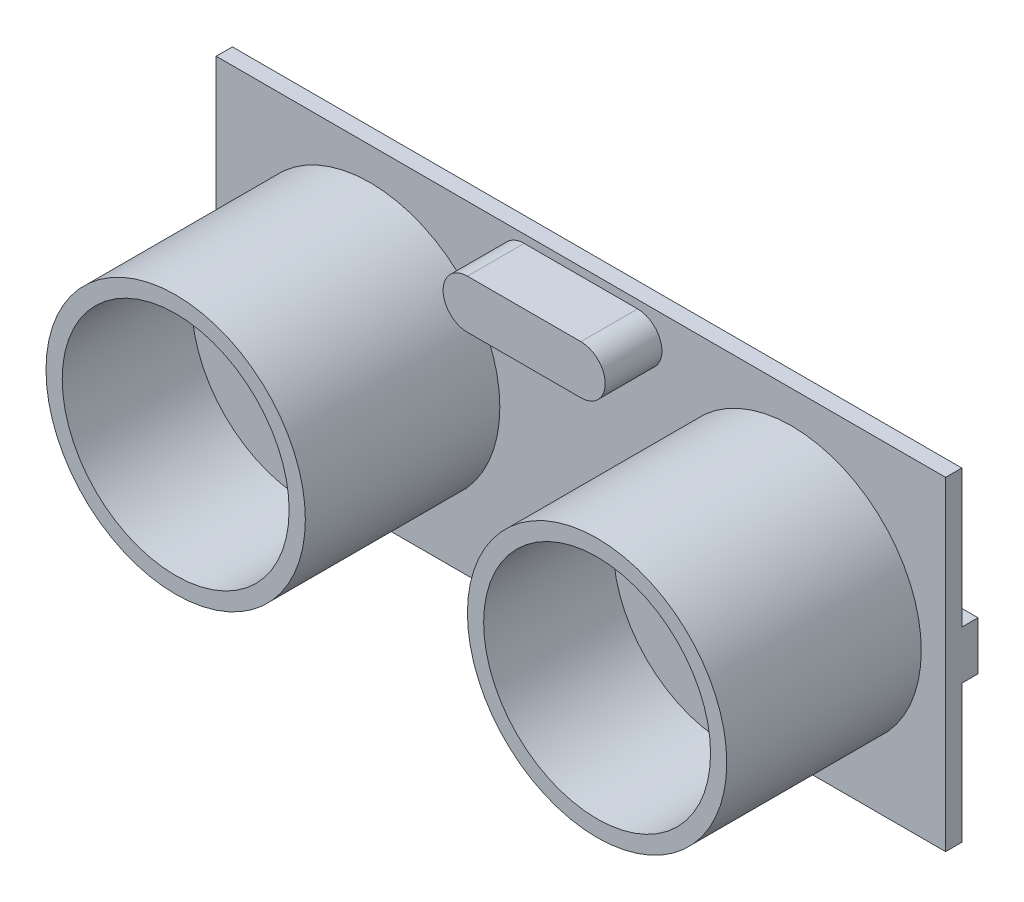
ISO-10303-21;
HEADER;
FILE_DESCRIPTION(('STEP AP214'),'2;1');
FILE_NAME('part.step','',(''),(''),'','','');
FILE_SCHEMA(('AUTOMOTIVE_DESIGN { 1 0 10303 214 1 1 1 1 }'));
ENDSEC;
DATA;
#1=APPLICATION_CONTEXT('core data for automotive mechanical design processes');
#2=APPLICATION_PROTOCOL_DEFINITION('international standard','automotive_design',2000,#1);
#3=PRODUCT_CONTEXT('',#1,'mechanical');
#4=PRODUCT('Part','Part','',(#3));
#5=PRODUCT_RELATED_PRODUCT_CATEGORY('part','',(#4));
#6=PRODUCT_DEFINITION_FORMATION('','',#4);
#7=PRODUCT_DEFINITION_CONTEXT('part definition',#1,'design');
#8=PRODUCT_DEFINITION('design','',#6,#7);
#9=PRODUCT_DEFINITION_SHAPE('','',#8);
#10=(LENGTH_UNIT() NAMED_UNIT(*) SI_UNIT(.MILLI.,.METRE.));
#11=(NAMED_UNIT(*) PLANE_ANGLE_UNIT() SI_UNIT($,.RADIAN.));
#12=(NAMED_UNIT(*) SI_UNIT($,.STERADIAN.) SOLID_ANGLE_UNIT());
#13=UNCERTAINTY_MEASURE_WITH_UNIT(LENGTH_MEASURE(1.E-05),#10,'distance_accuracy_value','');
#14=(GEOMETRIC_REPRESENTATION_CONTEXT(3) GLOBAL_UNCERTAINTY_ASSIGNED_CONTEXT((#13)) GLOBAL_UNIT_ASSIGNED_CONTEXT((#10,
#11,#12)) REPRESENTATION_CONTEXT('',''));
#15=CARTESIAN_POINT('',(0.,0.,0.));
#16=DIRECTION('',(0.,0.,1.));
#17=DIRECTION('',(1.,0.,0.));
#18=AXIS2_PLACEMENT_3D('',#15,#16,#17);
#19=CARTESIAN_POINT('',(0.,0.,0.));
#20=DIRECTION('',(0.,0.,-1.));
#21=DIRECTION('',(-1.,0.,0.));
#22=AXIS2_PLACEMENT_3D('',#19,#20,#21);
#23=PLANE('',#22);
#24=DIRECTION('',(1.,0.,0.));
#25=VECTOR('',#24,1.);
#26=CARTESIAN_POINT('',(3.,1.5,0.));
#27=LINE('',#26,#25);
#28=CARTESIAN_POINT('',(-3.,1.5,0.));
#29=VERTEX_POINT('',#28);
#30=CARTESIAN_POINT('',(3.,1.5,0.));
#31=VERTEX_POINT('',#30);
#32=EDGE_CURVE('E292',#29,#31,#27,.T.);
#33=ORIENTED_EDGE('',*,*,#32,.F.);
#34=DIRECTION('',(0.,1.,0.));
#35=VECTOR('',#34,1.);
#36=CARTESIAN_POINT('',(-3.,1.5,0.));
#37=LINE('',#36,#35);
#38=CARTESIAN_POINT('',(-3.,-1.5,0.));
#39=VERTEX_POINT('',#38);
#40=EDGE_CURVE('E278',#39,#29,#37,.T.);
#41=ORIENTED_EDGE('',*,*,#40,.F.);
#42=DIRECTION('',(-1.,0.,0.));
#43=VECTOR('',#42,1.);
#44=CARTESIAN_POINT('',(3.,-1.5,0.));
#45=LINE('',#44,#43);
#46=CARTESIAN_POINT('',(3.,-1.5,0.));
#47=VERTEX_POINT('',#46);
#48=EDGE_CURVE('E283',#47,#39,#45,.T.);
#49=ORIENTED_EDGE('',*,*,#48,.F.);
#50=DIRECTION('',(0.,-1.,0.));
#51=VECTOR('',#50,1.);
#52=CARTESIAN_POINT('',(3.,1.5,0.));
#53=LINE('',#52,#51);
#54=EDGE_CURVE('E294',#31,#47,#53,.T.);
#55=ORIENTED_EDGE('',*,*,#54,.F.);
#56=EDGE_LOOP('',(#33,#41,#49,#55));
#57=FACE_BOUND('',#56,.T.);
#58=DIRECTION('',(1.,0.,0.));
#59=VECTOR('',#58,1.);
#60=CARTESIAN_POINT('',(-16.9493977736266,3.25,0.));
#61=LINE('',#60,#59);
#62=CARTESIAN_POINT('',(-19.9493977736266,3.25,0.));
#63=VERTEX_POINT('',#62);
#64=CARTESIAN_POINT('',(-16.9493977736266,3.25,0.));
#65=VERTEX_POINT('',#64);
#66=EDGE_CURVE('E224',#63,#65,#61,.T.);
#67=ORIENTED_EDGE('',*,*,#66,.F.);
#68=DIRECTION('',(0.,1.,0.));
#69=VECTOR('',#68,1.);
#70=CARTESIAN_POINT('',(-19.9493977736266,-3.25,0.));
#71=LINE('',#70,#69);
#72=CARTESIAN_POINT('',(-19.9493977736266,-3.25,0.));
#73=VERTEX_POINT('',#72);
#74=EDGE_CURVE('E221',#73,#63,#71,.T.);
#75=ORIENTED_EDGE('',*,*,#74,.F.);
#76=DIRECTION('',(-1.,0.,0.));
#77=VECTOR('',#76,1.);
#78=CARTESIAN_POINT('',(-16.9493977736266,-3.25,0.));
#79=LINE('',#78,#77);
#80=CARTESIAN_POINT('',(-16.9493977736266,-3.25,0.));
#81=VERTEX_POINT('',#80);
#82=EDGE_CURVE('E233',#81,#73,#79,.T.);
#83=ORIENTED_EDGE('',*,*,#82,.F.);
#84=DIRECTION('',(0.,-1.,0.));
#85=VECTOR('',#84,1.);
#86=CARTESIAN_POINT('',(-16.9493977736266,-3.25,0.));
#87=LINE('',#86,#85);
#88=EDGE_CURVE('E241',#65,#81,#87,.T.);
#89=ORIENTED_EDGE('',*,*,#88,.F.);
#90=EDGE_LOOP('',(#67,#75,#83,#89));
#91=FACE_BOUND('',#90,.T.);
#92=DIRECTION('',(1.,0.,0.));
#93=VECTOR('',#92,1.);
#94=CARTESIAN_POINT('',(6.34999999999999,-5.,0.));
#95=LINE('',#94,#93);
#96=CARTESIAN_POINT('',(-6.35000000000001,-5.,0.));
#97=VERTEX_POINT('',#96);
#98=CARTESIAN_POINT('',(6.34999999999999,-5.,0.));
#99=VERTEX_POINT('',#98);
#100=EDGE_CURVE('E424',#97,#99,#95,.T.);
#101=ORIENTED_EDGE('',*,*,#100,.F.);
#102=DIRECTION('',(0.,1.,0.));
#103=VECTOR('',#102,1.);
#104=CARTESIAN_POINT('',(-6.35000000000001,-5.,0.));
#105=LINE('',#104,#103);
#106=CARTESIAN_POINT('',(-6.35000000000001,-10.,0.));
#107=VERTEX_POINT('',#106);
#108=EDGE_CURVE('E219',#107,#97,#105,.T.);
#109=ORIENTED_EDGE('',*,*,#108,.F.);
#110=DIRECTION('',(1.,0.,0.));
#111=VECTOR('',#110,1.);
#112=CARTESIAN_POINT('',(-22.5,-10.,0.));
#113=LINE('',#112,#111);
#114=CARTESIAN_POINT('',(-22.5,-10.,0.));
#115=VERTEX_POINT('',#114);
#116=EDGE_CURVE('E362',#115,#107,#113,.T.);
#117=ORIENTED_EDGE('',*,*,#116,.F.);
#118=DIRECTION('',(0.,-1.,0.));
#119=VECTOR('',#118,1.);
#120=CARTESIAN_POINT('',(-22.5,-10.,0.));
#121=LINE('',#120,#119);
#122=CARTESIAN_POINT('',(-22.5,10.,0.));
#123=VERTEX_POINT('',#122);
#124=EDGE_CURVE('E374',#123,#115,#121,.T.);
#125=ORIENTED_EDGE('',*,*,#124,.F.);
#126=DIRECTION('',(-1.,0.,0.));
#127=VECTOR('',#126,1.);
#128=CARTESIAN_POINT('',(-22.5,10.,0.));
#129=LINE('',#128,#127);
#130=CARTESIAN_POINT('',(22.5,10.,0.));
#131=VERTEX_POINT('',#130);
#132=EDGE_CURVE('E372',#131,#123,#129,.T.);
#133=ORIENTED_EDGE('',*,*,#132,.F.);
#134=DIRECTION('',(0.,1.,0.));
#135=VECTOR('',#134,1.);
#136=CARTESIAN_POINT('',(22.5,-10.,0.));
#137=LINE('',#136,#135);
#138=CARTESIAN_POINT('',(22.5,1.5,0.));
#139=VERTEX_POINT('',#138);
#140=EDGE_CURVE('E357',#139,#131,#137,.T.);
#141=ORIENTED_EDGE('',*,*,#140,.F.);
#142=DIRECTION('',(1.,0.,0.));
#143=VECTOR('',#142,1.);
#144=CARTESIAN_POINT('',(22.5,1.5,0.));
#145=LINE('',#144,#143);
#146=CARTESIAN_POINT('',(16.5,1.5,0.));
#147=VERTEX_POINT('',#146);
#148=EDGE_CURVE('E266',#147,#139,#145,.T.);
#149=ORIENTED_EDGE('',*,*,#148,.F.);
#150=DIRECTION('',(0.,1.,0.));
#151=VECTOR('',#150,1.);
#152=CARTESIAN_POINT('',(16.5,1.5,0.));
#153=LINE('',#152,#151);
#154=CARTESIAN_POINT('',(16.5,-1.5,0.));
#155=VERTEX_POINT('',#154);
#156=EDGE_CURVE('E252',#155,#147,#153,.T.);
#157=ORIENTED_EDGE('',*,*,#156,.F.);
#158=DIRECTION('',(-1.,0.,0.));
#159=VECTOR('',#158,1.);
#160=CARTESIAN_POINT('',(22.5,-1.5,0.));
#161=LINE('',#160,#159);
#162=CARTESIAN_POINT('',(22.5,-1.5,0.));
#163=VERTEX_POINT('',#162);
#164=EDGE_CURVE('E257',#163,#155,#161,.T.);
#165=ORIENTED_EDGE('',*,*,#164,.F.);
#166=CARTESIAN_POINT('',(22.5,-10.,0.));
#167=VERTEX_POINT('',#166);
#168=EDGE_CURVE('E369',#167,#163,#137,.T.);
#169=ORIENTED_EDGE('',*,*,#168,.F.);
#170=CARTESIAN_POINT('',(6.34999999999998,-10.,0.));
#171=VERTEX_POINT('',#170);
#172=EDGE_CURVE('E376',#171,#167,#113,.T.);
#173=ORIENTED_EDGE('',*,*,#172,.F.);
#174=DIRECTION('',(0.,-1.,0.));
#175=VECTOR('',#174,1.);
#176=CARTESIAN_POINT('',(6.34999999999999,-5.,0.));
#177=LINE('',#176,#175);
#178=EDGE_CURVE('E215',#99,#171,#177,.T.);
#179=ORIENTED_EDGE('',*,*,#178,.F.);
#180=EDGE_LOOP('',(#101,#109,#117,#125,#133,#141,#149,#157,#165,#169,#173,#179));
#181=FACE_BOUND('',#180,.T.);
#182=ADVANCED_FACE('F35',(#57,#91,#181),#23,.T.);
#183=CARTESIAN_POINT('',(22.5,-10.,1.));
#184=DIRECTION('',(-1.,0.,0.));
#185=DIRECTION('',(0.,0.,1.));
#186=AXIS2_PLACEMENT_3D('',#183,#184,#185);
#187=PLANE('',#186);
#188=ORIENTED_EDGE('',*,*,#168,.T.);
#189=DIRECTION('',(0.,0.,1.));
#190=VECTOR('',#189,1.);
#191=CARTESIAN_POINT('',(22.5,-1.5,-1.));
#192=LINE('',#191,#190);
#193=CARTESIAN_POINT('',(22.5,-1.5,-1.));
#194=VERTEX_POINT('',#193);
#195=EDGE_CURVE('E272',#194,#163,#192,.T.);
#196=ORIENTED_EDGE('',*,*,#195,.F.);
#197=DIRECTION('',(0.,-1.,0.));
#198=VECTOR('',#197,1.);
#199=CARTESIAN_POINT('',(22.5,1.5,-1.));
#200=LINE('',#199,#198);
#201=CARTESIAN_POINT('',(22.5,1.5,-1.));
#202=VERTEX_POINT('',#201);
#203=EDGE_CURVE('E259',#202,#194,#200,.T.);
#204=ORIENTED_EDGE('',*,*,#203,.F.);
#205=DIRECTION('',(0.,0.,1.));
#206=VECTOR('',#205,1.);
#207=CARTESIAN_POINT('',(22.5,1.5,-1.));
#208=LINE('',#207,#206);
#209=EDGE_CURVE('E274',#202,#139,#208,.T.);
#210=ORIENTED_EDGE('',*,*,#209,.T.);
#211=ORIENTED_EDGE('',*,*,#140,.T.);
#212=DIRECTION('',(0.,0.,-1.));
#213=VECTOR('',#212,1.);
#214=CARTESIAN_POINT('',(22.5,10.,1.));
#215=LINE('',#214,#213);
#216=CARTESIAN_POINT('',(22.5,10.,1.));
#217=VERTEX_POINT('',#216);
#218=EDGE_CURVE('E387',#217,#131,#215,.T.);
#219=ORIENTED_EDGE('',*,*,#218,.F.);
#220=DIRECTION('',(0.,1.,0.));
#221=VECTOR('',#220,1.);
#222=CARTESIAN_POINT('',(22.5,-10.,1.));
#223=LINE('',#222,#221);
#224=CARTESIAN_POINT('',(22.5,-10.,1.));
#225=VERTEX_POINT('',#224);
#226=EDGE_CURVE('E358',#225,#217,#223,.T.);
#227=ORIENTED_EDGE('',*,*,#226,.F.);
#228=DIRECTION('',(0.,0.,-1.));
#229=VECTOR('',#228,1.);
#230=CARTESIAN_POINT('',(22.5,-10.,1.));
#231=LINE('',#230,#229);
#232=EDGE_CURVE('E368',#225,#167,#231,.T.);
#233=ORIENTED_EDGE('',*,*,#232,.T.);
#234=EDGE_LOOP('',(#188,#196,#204,#210,#211,#219,#227,#233));
#235=FACE_BOUND('',#234,.T.);
#236=ADVANCED_FACE('F37',(#235),#187,.F.);
#237=CARTESIAN_POINT('',(-22.5,10.,1.));
#238=DIRECTION('',(0.,-1.,0.));
#239=DIRECTION('',(0.,0.,-1.));
#240=AXIS2_PLACEMENT_3D('',#237,#238,#239);
#241=PLANE('',#240);
#242=ORIENTED_EDGE('',*,*,#132,.T.);
#243=DIRECTION('',(0.,0.,-1.));
#244=VECTOR('',#243,1.);
#245=CARTESIAN_POINT('',(-22.5,10.,1.));
#246=LINE('',#245,#244);
#247=CARTESIAN_POINT('',(-22.5,10.,1.));
#248=VERTEX_POINT('',#247);
#249=EDGE_CURVE('E384',#248,#123,#246,.T.);
#250=ORIENTED_EDGE('',*,*,#249,.F.);
#251=DIRECTION('',(-1.,0.,0.));
#252=VECTOR('',#251,1.);
#253=CARTESIAN_POINT('',(-22.5,10.,1.));
#254=LINE('',#253,#252);
#255=EDGE_CURVE('E361',#217,#248,#254,.T.);
#256=ORIENTED_EDGE('',*,*,#255,.F.);
#257=ORIENTED_EDGE('',*,*,#218,.T.);
#258=EDGE_LOOP('',(#242,#250,#256,#257));
#259=FACE_BOUND('',#258,.T.);
#260=ADVANCED_FACE('F466',(#259),#241,.F.);
#261=CARTESIAN_POINT('',(-22.5,-10.,1.));
#262=DIRECTION('',(1.,0.,0.));
#263=DIRECTION('',(0.,0.,-1.));
#264=AXIS2_PLACEMENT_3D('',#261,#262,#263);
#265=PLANE('',#264);
#266=ORIENTED_EDGE('',*,*,#124,.T.);
#267=DIRECTION('',(0.,0.,-1.));
#268=VECTOR('',#267,1.);
#269=CARTESIAN_POINT('',(-22.5,-10.,1.));
#270=LINE('',#269,#268);
#271=CARTESIAN_POINT('',(-22.5,-10.,1.));
#272=VERTEX_POINT('',#271);
#273=EDGE_CURVE('E381',#272,#115,#270,.T.);
#274=ORIENTED_EDGE('',*,*,#273,.F.);
#275=DIRECTION('',(0.,-1.,0.));
#276=VECTOR('',#275,1.);
#277=CARTESIAN_POINT('',(-22.5,-10.,1.));
#278=LINE('',#277,#276);
#279=EDGE_CURVE('E364',#248,#272,#278,.T.);
#280=ORIENTED_EDGE('',*,*,#279,.F.);
#281=ORIENTED_EDGE('',*,*,#249,.T.);
#282=EDGE_LOOP('',(#266,#274,#280,#281));
#283=FACE_BOUND('',#282,.T.);
#284=ADVANCED_FACE('F410',(#283),#265,.F.);
#285=CARTESIAN_POINT('',(-22.5,-10.,1.));
#286=DIRECTION('',(0.,1.,0.));
#287=DIRECTION('',(0.,0.,1.));
#288=AXIS2_PLACEMENT_3D('',#285,#286,#287);
#289=PLANE('',#288);
#290=CARTESIAN_POINT('',(3.76999999999999,-10.,-2.09800404078398));
#291=DIRECTION('',(0.,1.,0.));
#292=DIRECTION('',(0.,0.,1.));
#293=AXIS2_PLACEMENT_3D('',#290,#291,#292);
#294=CIRCLE('',#293,0.5);
#295=CARTESIAN_POINT('',(3.76999999999999,-10.,-1.59800404078398));
#296=VERTEX_POINT('',#295);
#297=EDGE_CURVE('E11',#296,#296,#294,.F.);
#298=ORIENTED_EDGE('',*,*,#297,.F.);
#299=EDGE_LOOP('',(#298));
#300=FACE_BOUND('',#299,.T.);
#301=CARTESIAN_POINT('',(1.23,-10.,-2.09800404078398));
#302=DIRECTION('',(0.,1.,0.));
#303=DIRECTION('',(0.,0.,1.));
#304=AXIS2_PLACEMENT_3D('',#301,#302,#303);
#305=CIRCLE('',#304,0.5);
#306=CARTESIAN_POINT('',(1.23,-10.,-1.59800404078398));
#307=VERTEX_POINT('',#306);
#308=EDGE_CURVE('E43',#307,#307,#305,.F.);
#309=ORIENTED_EDGE('',*,*,#308,.F.);
#310=EDGE_LOOP('',(#309));
#311=FACE_BOUND('',#310,.T.);
#312=CARTESIAN_POINT('',(-1.31000000000001,-10.,-2.09800404078398));
#313=DIRECTION('',(0.,1.,0.));
#314=DIRECTION('',(0.,0.,1.));
#315=AXIS2_PLACEMENT_3D('',#312,#313,#314);
#316=CIRCLE('',#315,0.5);
#317=CARTESIAN_POINT('',(-1.31000000000001,-10.,-1.59800404078398));
#318=VERTEX_POINT('',#317);
#319=EDGE_CURVE('E399',#318,#318,#316,.F.);
#320=ORIENTED_EDGE('',*,*,#319,.F.);
#321=EDGE_LOOP('',(#320));
#322=FACE_BOUND('',#321,.T.);
#323=CARTESIAN_POINT('',(-3.85000000000001,-10.,-2.09800404078398));
#324=DIRECTION('',(0.,1.,0.));
#325=DIRECTION('',(0.,0.,1.));
#326=AXIS2_PLACEMENT_3D('',#323,#324,#325);
#327=CIRCLE('',#326,0.5);
#328=CARTESIAN_POINT('',(-3.85000000000001,-10.,-1.59800404078398));
#329=VERTEX_POINT('',#328);
#330=EDGE_CURVE('E396',#329,#329,#327,.F.);
#331=ORIENTED_EDGE('',*,*,#330,.F.);
#332=EDGE_LOOP('',(#331));
#333=FACE_BOUND('',#332,.T.);
#334=ORIENTED_EDGE('',*,*,#116,.T.);
#335=DIRECTION('',(0.,0.,1.));
#336=VECTOR('',#335,1.);
#337=CARTESIAN_POINT('',(-6.35000000000001,-10.,-4.));
#338=LINE('',#337,#336);
#339=CARTESIAN_POINT('',(-6.35000000000001,-10.,-4.));
#340=VERTEX_POINT('',#339);
#341=EDGE_CURVE('E417',#340,#107,#338,.T.);
#342=ORIENTED_EDGE('',*,*,#341,.F.);
#343=DIRECTION('',(-1.,0.,0.));
#344=VECTOR('',#343,1.);
#345=CARTESIAN_POINT('',(6.34999999999999,-10.,-4.));
#346=LINE('',#345,#344);
#347=CARTESIAN_POINT('',(6.34999999999999,-10.,-4.));
#348=VERTEX_POINT('',#347);
#349=EDGE_CURVE('E212',#348,#340,#346,.T.);
#350=ORIENTED_EDGE('',*,*,#349,.F.);
#351=DIRECTION('',(0.,0.,1.));
#352=VECTOR('',#351,1.);
#353=CARTESIAN_POINT('',(6.34999999999999,-10.,-4.));
#354=LINE('',#353,#352);
#355=EDGE_CURVE('E50',#348,#171,#354,.T.);
#356=ORIENTED_EDGE('',*,*,#355,.T.);
#357=ORIENTED_EDGE('',*,*,#172,.T.);
#358=ORIENTED_EDGE('',*,*,#232,.F.);
#359=DIRECTION('',(1.,0.,0.));
#360=VECTOR('',#359,1.);
#361=CARTESIAN_POINT('',(-22.5,-10.,1.));
#362=LINE('',#361,#360);
#363=EDGE_CURVE('E366',#272,#225,#362,.T.);
#364=ORIENTED_EDGE('',*,*,#363,.F.);
#365=ORIENTED_EDGE('',*,*,#273,.T.);
#366=EDGE_LOOP('',(#334,#342,#350,#356,#357,#358,#364,#365));
#367=FACE_BOUND('',#366,.T.);
#368=ADVANCED_FACE('F406',(#300,#311,#322,#333,#367),#289,.F.);
#369=CARTESIAN_POINT('',(0.,0.,1.));
#370=DIRECTION('',(0.,0.,-1.));
#371=DIRECTION('',(-1.,0.,0.));
#372=AXIS2_PLACEMENT_3D('',#369,#370,#371);
#373=PLANE('',#372);
#374=DIRECTION('',(1.,0.,0.));
#375=VECTOR('',#374,1.);
#376=CARTESIAN_POINT('',(-3.5,6.5,1.));
#377=LINE('',#376,#375);
#378=CARTESIAN_POINT('',(-3.5,6.5,1.));
#379=VERTEX_POINT('',#378);
#380=CARTESIAN_POINT('',(3.5,6.5,1.));
#381=VERTEX_POINT('',#380);
#382=EDGE_CURVE('E324',#379,#381,#377,.T.);
#383=ORIENTED_EDGE('',*,*,#382,.F.);
#384=CARTESIAN_POINT('',(-3.5,8.,1.));
#385=DIRECTION('',(0.,0.,-1.));
#386=DIRECTION('',(-1.,0.,0.));
#387=AXIS2_PLACEMENT_3D('',#384,#385,#386);
#388=CIRCLE('',#387,1.5);
#389=CARTESIAN_POINT('',(-3.5,9.5,1.));
#390=VERTEX_POINT('',#389);
#391=EDGE_CURVE('E311',#379,#390,#388,.T.);
#392=ORIENTED_EDGE('',*,*,#391,.T.);
#393=DIRECTION('',(1.,0.,0.));
#394=VECTOR('',#393,1.);
#395=CARTESIAN_POINT('',(-3.5,9.5,1.));
#396=LINE('',#395,#394);
#397=CARTESIAN_POINT('',(3.5,9.5,1.));
#398=VERTEX_POINT('',#397);
#399=EDGE_CURVE('E335',#390,#398,#396,.T.);
#400=ORIENTED_EDGE('',*,*,#399,.T.);
#401=CARTESIAN_POINT('',(3.5,8.,1.));
#402=DIRECTION('',(0.,0.,-1.));
#403=DIRECTION('',(-1.,0.,0.));
#404=AXIS2_PLACEMENT_3D('',#401,#402,#403);
#405=CIRCLE('',#404,1.5);
#406=EDGE_CURVE('E338',#398,#381,#405,.T.);
#407=ORIENTED_EDGE('',*,*,#406,.T.);
#408=EDGE_LOOP('',(#383,#392,#400,#407));
#409=FACE_BOUND('',#408,.T.);
#410=CARTESIAN_POINT('',(-13.,0.,1.));
#411=DIRECTION('',(0.,0.,-1.));
#412=DIRECTION('',(-1.,0.,0.));
#413=AXIS2_PLACEMENT_3D('',#410,#411,#412);
#414=CIRCLE('',#413,8.);
#415=CARTESIAN_POINT('',(-21.,0.,1.));
#416=VERTEX_POINT('',#415);
#417=EDGE_CURVE('E393',#416,#416,#414,.F.);
#418=ORIENTED_EDGE('',*,*,#417,.F.);
#419=EDGE_LOOP('',(#418));
#420=FACE_BOUND('',#419,.T.);
#421=CARTESIAN_POINT('',(13.,0.,1.));
#422=DIRECTION('',(0.,0.,-1.));
#423=DIRECTION('',(-1.,0.,0.));
#424=AXIS2_PLACEMENT_3D('',#421,#422,#423);
#425=CIRCLE('',#424,8.);
#426=CARTESIAN_POINT('',(5.,0.,1.));
#427=VERTEX_POINT('',#426);
#428=EDGE_CURVE('E390',#427,#427,#425,.F.);
#429=ORIENTED_EDGE('',*,*,#428,.F.);
#430=EDGE_LOOP('',(#429));
#431=FACE_BOUND('',#430,.T.);
#432=ORIENTED_EDGE('',*,*,#226,.T.);
#433=ORIENTED_EDGE('',*,*,#255,.T.);
#434=ORIENTED_EDGE('',*,*,#279,.T.);
#435=ORIENTED_EDGE('',*,*,#363,.T.);
#436=EDGE_LOOP('',(#432,#433,#434,#435));
#437=FACE_BOUND('',#436,.T.);
#438=ADVANCED_FACE('F409',(#409,#420,#431,#437),#373,.F.);
#439=CARTESIAN_POINT('',(13.,0.,13.));
#440=DIRECTION('',(0.,0.,-1.));
#441=DIRECTION('',(-1.,0.,0.));
#442=AXIS2_PLACEMENT_3D('',#439,#440,#441);
#443=CYLINDRICAL_SURFACE('',#442,8.);
#444=CARTESIAN_POINT('',(13.,0.,13.));
#445=DIRECTION('',(0.,0.,1.));
#446=DIRECTION('',(1.,0.,0.));
#447=AXIS2_PLACEMENT_3D('',#444,#445,#446);
#448=CIRCLE('',#447,8.);
#449=CARTESIAN_POINT('',(21.,0.,13.));
#450=VERTEX_POINT('',#449);
#451=EDGE_CURVE('E354',#450,#450,#448,.T.);
#452=ORIENTED_EDGE('',*,*,#451,.F.);
#453=EDGE_LOOP('',(#452));
#454=FACE_BOUND('',#453,.T.);
#455=ORIENTED_EDGE('',*,*,#428,.T.);
#456=EDGE_LOOP('',(#455));
#457=FACE_BOUND('',#456,.T.);
#458=ADVANCED_FACE('F614',(#454,#457),#443,.T.);
#459=CARTESIAN_POINT('',(13.,0.,13.));
#460=DIRECTION('',(0.,0.,1.));
#461=DIRECTION('',(1.,0.,0.));
#462=AXIS2_PLACEMENT_3D('',#459,#460,#461);
#463=PLANE('',#462);
#464=CARTESIAN_POINT('',(13.,0.,13.));
#465=DIRECTION('',(0.,0.,1.));
#466=DIRECTION('',(1.,0.,0.));
#467=AXIS2_PLACEMENT_3D('',#464,#465,#466);
#468=CIRCLE('',#467,7.);
#469=CARTESIAN_POINT('',(20.,0.,13.));
#470=VERTEX_POINT('',#469);
#471=EDGE_CURVE('E312',#470,#470,#468,.T.);
#472=ORIENTED_EDGE('',*,*,#471,.F.);
#473=EDGE_LOOP('',(#472));
#474=FACE_BOUND('',#473,.T.);
#475=ORIENTED_EDGE('',*,*,#451,.T.);
#476=EDGE_LOOP('',(#475));
#477=FACE_BOUND('',#476,.T.);
#478=ADVANCED_FACE('F611',(#474,#477),#463,.T.);
#479=CARTESIAN_POINT('',(-13.,0.,13.));
#480=DIRECTION('',(0.,0.,-1.));
#481=DIRECTION('',(-1.,0.,0.));
#482=AXIS2_PLACEMENT_3D('',#479,#480,#481);
#483=CYLINDRICAL_SURFACE('',#482,8.);
#484=CARTESIAN_POINT('',(-13.,0.,13.));
#485=DIRECTION('',(0.,0.,1.));
#486=DIRECTION('',(-1.,0.,0.));
#487=AXIS2_PLACEMENT_3D('',#484,#485,#486);
#488=CIRCLE('',#487,8.);
#489=CARTESIAN_POINT('',(-21.,0.,13.));
#490=VERTEX_POINT('',#489);
#491=EDGE_CURVE('E345',#490,#490,#488,.T.);
#492=ORIENTED_EDGE('',*,*,#491,.F.);
#493=EDGE_LOOP('',(#492));
#494=FACE_BOUND('',#493,.T.);
#495=ORIENTED_EDGE('',*,*,#417,.T.);
#496=EDGE_LOOP('',(#495));
#497=FACE_BOUND('',#496,.T.);
#498=ADVANCED_FACE('F607',(#494,#497),#483,.T.);
#499=CARTESIAN_POINT('',(-13.,0.,13.));
#500=DIRECTION('',(0.,0.,-1.));
#501=DIRECTION('',(-1.,0.,0.));
#502=AXIS2_PLACEMENT_3D('',#499,#500,#501);
#503=PLANE('',#502);
#504=CARTESIAN_POINT('',(-13.,0.,13.));
#505=DIRECTION('',(0.,0.,1.));
#506=DIRECTION('',(-1.,0.,0.));
#507=AXIS2_PLACEMENT_3D('',#504,#505,#506);
#508=CIRCLE('',#507,7.);
#509=CARTESIAN_POINT('',(-20.,0.,13.));
#510=VERTEX_POINT('',#509);
#511=EDGE_CURVE('E307',#510,#510,#508,.T.);
#512=ORIENTED_EDGE('',*,*,#511,.F.);
#513=EDGE_LOOP('',(#512));
#514=FACE_BOUND('',#513,.T.);
#515=ORIENTED_EDGE('',*,*,#491,.T.);
#516=EDGE_LOOP('',(#515));
#517=FACE_BOUND('',#516,.T.);
#518=ADVANCED_FACE('F603',(#514,#517),#503,.F.);
#519=CARTESIAN_POINT('',(-3.5,8.,4.5));
#520=DIRECTION('',(0.,0.,-1.));
#521=DIRECTION('',(-1.,0.,0.));
#522=AXIS2_PLACEMENT_3D('',#519,#520,#521);
#523=CYLINDRICAL_SURFACE('',#522,1.5);
#524=ORIENTED_EDGE('',*,*,#391,.F.);
#525=DIRECTION('',(0.,0.,-1.));
#526=VECTOR('',#525,1.);
#527=CARTESIAN_POINT('',(-3.5,6.5,4.5));
#528=LINE('',#527,#526);
#529=CARTESIAN_POINT('',(-3.5,6.5,4.5));
#530=VERTEX_POINT('',#529);
#531=EDGE_CURVE('E343',#530,#379,#528,.T.);
#532=ORIENTED_EDGE('',*,*,#531,.F.);
#533=CARTESIAN_POINT('',(-3.5,8.,4.5));
#534=DIRECTION('',(0.,0.,-1.));
#535=DIRECTION('',(-1.,0.,0.));
#536=AXIS2_PLACEMENT_3D('',#533,#534,#535);
#537=CIRCLE('',#536,1.5);
#538=CARTESIAN_POINT('',(-3.5,9.5,4.5));
#539=VERTEX_POINT('',#538);
#540=EDGE_CURVE('E320',#530,#539,#537,.T.);
#541=ORIENTED_EDGE('',*,*,#540,.T.);
#542=DIRECTION('',(0.,0.,-1.));
#543=VECTOR('',#542,1.);
#544=CARTESIAN_POINT('',(-3.5,9.5,4.5));
#545=LINE('',#544,#543);
#546=EDGE_CURVE('E332',#539,#390,#545,.T.);
#547=ORIENTED_EDGE('',*,*,#546,.T.);
#548=EDGE_LOOP('',(#524,#532,#541,#547));
#549=FACE_BOUND('',#548,.T.);
#550=ADVANCED_FACE('F593',(#549),#523,.T.);
#551=CARTESIAN_POINT('',(-3.5,6.5,4.5));
#552=DIRECTION('',(0.,1.,0.));
#553=DIRECTION('',(0.,0.,1.));
#554=AXIS2_PLACEMENT_3D('',#551,#552,#553);
#555=PLANE('',#554);
#556=ORIENTED_EDGE('',*,*,#382,.T.);
#557=DIRECTION('',(0.,0.,-1.));
#558=VECTOR('',#557,1.);
#559=CARTESIAN_POINT('',(3.5,6.5,4.5));
#560=LINE('',#559,#558);
#561=CARTESIAN_POINT('',(3.5,6.5,4.5));
#562=VERTEX_POINT('',#561);
#563=EDGE_CURVE('E346',#562,#381,#560,.T.);
#564=ORIENTED_EDGE('',*,*,#563,.F.);
#565=DIRECTION('',(1.,0.,0.));
#566=VECTOR('',#565,1.);
#567=CARTESIAN_POINT('',(-3.5,6.5,4.5));
#568=LINE('',#567,#566);
#569=EDGE_CURVE('E330',#530,#562,#568,.T.);
#570=ORIENTED_EDGE('',*,*,#569,.F.);
#571=ORIENTED_EDGE('',*,*,#531,.T.);
#572=EDGE_LOOP('',(#556,#564,#570,#571));
#573=FACE_BOUND('',#572,.T.);
#574=ADVANCED_FACE('F589',(#573),#555,.F.);
#575=CARTESIAN_POINT('',(3.5,8.,4.5));
#576=DIRECTION('',(0.,0.,-1.));
#577=DIRECTION('',(-1.,0.,0.));
#578=AXIS2_PLACEMENT_3D('',#575,#576,#577);
#579=CYLINDRICAL_SURFACE('',#578,1.5);
#580=ORIENTED_EDGE('',*,*,#406,.F.);
#581=DIRECTION('',(0.,0.,-1.));
#582=VECTOR('',#581,1.);
#583=CARTESIAN_POINT('',(3.5,9.5,4.5));
#584=LINE('',#583,#582);
#585=CARTESIAN_POINT('',(3.5,9.5,4.5));
#586=VERTEX_POINT('',#585);
#587=EDGE_CURVE('E348',#586,#398,#584,.T.);
#588=ORIENTED_EDGE('',*,*,#587,.F.);
#589=CARTESIAN_POINT('',(3.5,8.,4.5));
#590=DIRECTION('',(0.,0.,-1.));
#591=DIRECTION('',(-1.,0.,0.));
#592=AXIS2_PLACEMENT_3D('',#589,#590,#591);
#593=CIRCLE('',#592,1.5);
#594=EDGE_CURVE('E327',#586,#562,#593,.T.);
#595=ORIENTED_EDGE('',*,*,#594,.T.);
#596=ORIENTED_EDGE('',*,*,#563,.T.);
#597=EDGE_LOOP('',(#580,#588,#595,#596));
#598=FACE_BOUND('',#597,.T.);
#599=ADVANCED_FACE('F592',(#598),#579,.T.);
#600=CARTESIAN_POINT('',(-3.5,9.5,4.5));
#601=DIRECTION('',(0.,1.,0.));
#602=DIRECTION('',(0.,0.,1.));
#603=AXIS2_PLACEMENT_3D('',#600,#601,#602);
#604=PLANE('',#603);
#605=ORIENTED_EDGE('',*,*,#399,.F.);
#606=ORIENTED_EDGE('',*,*,#546,.F.);
#607=DIRECTION('',(1.,0.,0.));
#608=VECTOR('',#607,1.);
#609=CARTESIAN_POINT('',(-3.5,9.5,4.5));
#610=LINE('',#609,#608);
#611=EDGE_CURVE('E323',#539,#586,#610,.T.);
#612=ORIENTED_EDGE('',*,*,#611,.T.);
#613=ORIENTED_EDGE('',*,*,#587,.T.);
#614=EDGE_LOOP('',(#605,#606,#612,#613));
#615=FACE_BOUND('',#614,.T.);
#616=ADVANCED_FACE('F587',(#615),#604,.T.);
#617=CARTESIAN_POINT('',(-3.5,8.,4.5));
#618=DIRECTION('',(0.,0.,-1.));
#619=DIRECTION('',(-1.,0.,0.));
#620=AXIS2_PLACEMENT_3D('',#617,#618,#619);
#621=PLANE('',#620);
#622=ORIENTED_EDGE('',*,*,#540,.F.);
#623=ORIENTED_EDGE('',*,*,#569,.T.);
#624=ORIENTED_EDGE('',*,*,#594,.F.);
#625=ORIENTED_EDGE('',*,*,#611,.F.);
#626=EDGE_LOOP('',(#622,#623,#624,#625));
#627=FACE_BOUND('',#626,.T.);
#628=ADVANCED_FACE('F583',(#627),#621,.F.);
#629=CARTESIAN_POINT('',(-13.,0.,5.));
#630=DIRECTION('',(0.,0.,1.));
#631=DIRECTION('',(1.,0.,0.));
#632=AXIS2_PLACEMENT_3D('',#629,#630,#631);
#633=CYLINDRICAL_SURFACE('',#632,7.);
#634=CARTESIAN_POINT('',(-13.,0.,5.));
#635=DIRECTION('',(0.,0.,1.));
#636=DIRECTION('',(-1.,0.,0.));
#637=AXIS2_PLACEMENT_3D('',#634,#635,#636);
#638=CIRCLE('',#637,7.);
#639=CARTESIAN_POINT('',(-20.,0.,5.));
#640=VERTEX_POINT('',#639);
#641=EDGE_CURVE('E315',#640,#640,#638,.T.);
#642=ORIENTED_EDGE('',*,*,#641,.F.);
#643=EDGE_LOOP('',(#642));
#644=FACE_BOUND('',#643,.T.);
#645=ORIENTED_EDGE('',*,*,#511,.T.);
#646=EDGE_LOOP('',(#645));
#647=FACE_BOUND('',#646,.T.);
#648=ADVANCED_FACE('F579',(#644,#647),#633,.F.);
#649=CARTESIAN_POINT('',(-13.,0.,5.));
#650=DIRECTION('',(0.,0.,-1.));
#651=DIRECTION('',(-1.,0.,0.));
#652=AXIS2_PLACEMENT_3D('',#649,#650,#651);
#653=PLANE('',#652);
#654=ORIENTED_EDGE('',*,*,#641,.T.);
#655=EDGE_LOOP('',(#654));
#656=FACE_BOUND('',#655,.T.);
#657=ADVANCED_FACE('F575',(#656),#653,.F.);
#658=CARTESIAN_POINT('',(13.,0.,5.));
#659=DIRECTION('',(0.,0.,1.));
#660=DIRECTION('',(1.,0.,0.));
#661=AXIS2_PLACEMENT_3D('',#658,#659,#660);
#662=CYLINDRICAL_SURFACE('',#661,7.);
#663=CARTESIAN_POINT('',(13.,0.,5.));
#664=DIRECTION('',(0.,0.,1.));
#665=DIRECTION('',(1.,0.,0.));
#666=AXIS2_PLACEMENT_3D('',#663,#664,#665);
#667=CIRCLE('',#666,7.);
#668=CARTESIAN_POINT('',(20.,0.,5.));
#669=VERTEX_POINT('',#668);
#670=EDGE_CURVE('E308',#669,#669,#667,.T.);
#671=ORIENTED_EDGE('',*,*,#670,.F.);
#672=EDGE_LOOP('',(#671));
#673=FACE_BOUND('',#672,.T.);
#674=ORIENTED_EDGE('',*,*,#471,.T.);
#675=EDGE_LOOP('',(#674));
#676=FACE_BOUND('',#675,.T.);
#677=ADVANCED_FACE('F571',(#673,#676),#662,.F.);
#678=CARTESIAN_POINT('',(13.,0.,5.));
#679=DIRECTION('',(0.,0.,1.));
#680=DIRECTION('',(1.,0.,0.));
#681=AXIS2_PLACEMENT_3D('',#678,#679,#680);
#682=PLANE('',#681);
#683=ORIENTED_EDGE('',*,*,#670,.T.);
#684=EDGE_LOOP('',(#683));
#685=FACE_BOUND('',#684,.T.);
#686=ADVANCED_FACE('F567',(#685),#682,.T.);
#687=CARTESIAN_POINT('',(-3.,1.5,-1.));
#688=DIRECTION('',(1.,0.,0.));
#689=DIRECTION('',(0.,0.,-1.));
#690=AXIS2_PLACEMENT_3D('',#687,#688,#689);
#691=PLANE('',#690);
#692=ORIENTED_EDGE('',*,*,#40,.T.);
#693=DIRECTION('',(0.,0.,1.));
#694=VECTOR('',#693,1.);
#695=CARTESIAN_POINT('',(-3.,1.5,-1.));
#696=LINE('',#695,#694);
#697=CARTESIAN_POINT('',(-3.,1.5,-1.));
#698=VERTEX_POINT('',#697);
#699=EDGE_CURVE('E305',#698,#29,#696,.T.);
#700=ORIENTED_EDGE('',*,*,#699,.F.);
#701=DIRECTION('',(0.,1.,0.));
#702=VECTOR('',#701,1.);
#703=CARTESIAN_POINT('',(-3.,1.5,-1.));
#704=LINE('',#703,#702);
#705=CARTESIAN_POINT('',(-3.,-1.5,-1.));
#706=VERTEX_POINT('',#705);
#707=EDGE_CURVE('E279',#706,#698,#704,.T.);
#708=ORIENTED_EDGE('',*,*,#707,.F.);
#709=DIRECTION('',(0.,0.,1.));
#710=VECTOR('',#709,1.);
#711=CARTESIAN_POINT('',(-3.,-1.5,-1.));
#712=LINE('',#711,#710);
#713=EDGE_CURVE('E289',#706,#39,#712,.T.);
#714=ORIENTED_EDGE('',*,*,#713,.T.);
#715=EDGE_LOOP('',(#692,#700,#708,#714));
#716=FACE_BOUND('',#715,.T.);
#717=ADVANCED_FACE('F563',(#716),#691,.F.);
#718=CARTESIAN_POINT('',(3.,1.5,-1.));
#719=DIRECTION('',(0.,-1.,0.));
#720=DIRECTION('',(0.,0.,-1.));
#721=AXIS2_PLACEMENT_3D('',#718,#719,#720);
#722=PLANE('',#721);
#723=ORIENTED_EDGE('',*,*,#32,.T.);
#724=DIRECTION('',(0.,0.,1.));
#725=VECTOR('',#724,1.);
#726=CARTESIAN_POINT('',(3.,1.5,-1.));
#727=LINE('',#726,#725);
#728=CARTESIAN_POINT('',(3.,1.5,-1.));
#729=VERTEX_POINT('',#728);
#730=EDGE_CURVE('E302',#729,#31,#727,.T.);
#731=ORIENTED_EDGE('',*,*,#730,.F.);
#732=DIRECTION('',(1.,0.,0.));
#733=VECTOR('',#732,1.);
#734=CARTESIAN_POINT('',(3.,1.5,-1.));
#735=LINE('',#734,#733);
#736=EDGE_CURVE('E282',#698,#729,#735,.T.);
#737=ORIENTED_EDGE('',*,*,#736,.F.);
#738=ORIENTED_EDGE('',*,*,#699,.T.);
#739=EDGE_LOOP('',(#723,#731,#737,#738));
#740=FACE_BOUND('',#739,.T.);
#741=ADVANCED_FACE('F559',(#740),#722,.F.);
#742=CARTESIAN_POINT('',(3.,1.5,-1.));
#743=DIRECTION('',(-1.,0.,0.));
#744=DIRECTION('',(0.,0.,1.));
#745=AXIS2_PLACEMENT_3D('',#742,#743,#744);
#746=PLANE('',#745);
#747=ORIENTED_EDGE('',*,*,#54,.T.);
#748=DIRECTION('',(0.,0.,1.));
#749=VECTOR('',#748,1.);
#750=CARTESIAN_POINT('',(3.,-1.5,-1.));
#751=LINE('',#750,#749);
#752=CARTESIAN_POINT('',(3.,-1.5,-1.));
#753=VERTEX_POINT('',#752);
#754=EDGE_CURVE('E300',#753,#47,#751,.T.);
#755=ORIENTED_EDGE('',*,*,#754,.F.);
#756=DIRECTION('',(0.,-1.,0.));
#757=VECTOR('',#756,1.);
#758=CARTESIAN_POINT('',(3.,1.5,-1.));
#759=LINE('',#758,#757);
#760=EDGE_CURVE('E285',#729,#753,#759,.T.);
#761=ORIENTED_EDGE('',*,*,#760,.F.);
#762=ORIENTED_EDGE('',*,*,#730,.T.);
#763=EDGE_LOOP('',(#747,#755,#761,#762));
#764=FACE_BOUND('',#763,.T.);
#765=ADVANCED_FACE('F555',(#764),#746,.F.);
#766=CARTESIAN_POINT('',(3.,-1.5,-1.));
#767=DIRECTION('',(0.,1.,0.));
#768=DIRECTION('',(0.,0.,1.));
#769=AXIS2_PLACEMENT_3D('',#766,#767,#768);
#770=PLANE('',#769);
#771=ORIENTED_EDGE('',*,*,#48,.T.);
#772=ORIENTED_EDGE('',*,*,#713,.F.);
#773=DIRECTION('',(-1.,0.,0.));
#774=VECTOR('',#773,1.);
#775=CARTESIAN_POINT('',(3.,-1.5,-1.));
#776=LINE('',#775,#774);
#777=EDGE_CURVE('E287',#753,#706,#776,.T.);
#778=ORIENTED_EDGE('',*,*,#777,.F.);
#779=ORIENTED_EDGE('',*,*,#754,.T.);
#780=EDGE_LOOP('',(#771,#772,#778,#779));
#781=FACE_BOUND('',#780,.T.);
#782=ADVANCED_FACE('F551',(#781),#770,.F.);
#783=CARTESIAN_POINT('',(0.,0.,-1.));
#784=DIRECTION('',(0.,0.,-1.));
#785=DIRECTION('',(-1.,0.,0.));
#786=AXIS2_PLACEMENT_3D('',#783,#784,#785);
#787=PLANE('',#786);
#788=ORIENTED_EDGE('',*,*,#707,.T.);
#789=ORIENTED_EDGE('',*,*,#736,.T.);
#790=ORIENTED_EDGE('',*,*,#760,.T.);
#791=ORIENTED_EDGE('',*,*,#777,.T.);
#792=EDGE_LOOP('',(#788,#789,#790,#791));
#793=FACE_BOUND('',#792,.T.);
#794=ADVANCED_FACE('F548',(#793),#787,.T.);
#795=CARTESIAN_POINT('',(16.5,1.5,-1.));
#796=DIRECTION('',(1.,0.,0.));
#797=DIRECTION('',(0.,0.,-1.));
#798=AXIS2_PLACEMENT_3D('',#795,#796,#797);
#799=PLANE('',#798);
#800=ORIENTED_EDGE('',*,*,#156,.T.);
#801=DIRECTION('',(0.,0.,1.));
#802=VECTOR('',#801,1.);
#803=CARTESIAN_POINT('',(16.5,1.5,-1.));
#804=LINE('',#803,#802);
#805=CARTESIAN_POINT('',(16.5,1.5,-1.));
#806=VERTEX_POINT('',#805);
#807=EDGE_CURVE('E276',#806,#147,#804,.T.);
#808=ORIENTED_EDGE('',*,*,#807,.F.);
#809=DIRECTION('',(0.,1.,0.));
#810=VECTOR('',#809,1.);
#811=CARTESIAN_POINT('',(16.5,1.5,-1.));
#812=LINE('',#811,#810);
#813=CARTESIAN_POINT('',(16.5,-1.5,-1.));
#814=VERTEX_POINT('',#813);
#815=EDGE_CURVE('E253',#814,#806,#812,.T.);
#816=ORIENTED_EDGE('',*,*,#815,.F.);
#817=DIRECTION('',(0.,0.,1.));
#818=VECTOR('',#817,1.);
#819=CARTESIAN_POINT('',(16.5,-1.5,-1.));
#820=LINE('',#819,#818);
#821=EDGE_CURVE('E263',#814,#155,#820,.T.);
#822=ORIENTED_EDGE('',*,*,#821,.T.);
#823=EDGE_LOOP('',(#800,#808,#816,#822));
#824=FACE_BOUND('',#823,.T.);
#825=ADVANCED_FACE('F496',(#824),#799,.F.);
#826=CARTESIAN_POINT('',(22.5,1.5,-1.));
#827=DIRECTION('',(0.,-1.,0.));
#828=DIRECTION('',(0.,0.,-1.));
#829=AXIS2_PLACEMENT_3D('',#826,#827,#828);
#830=PLANE('',#829);
#831=ORIENTED_EDGE('',*,*,#148,.T.);
#832=ORIENTED_EDGE('',*,*,#209,.F.);
#833=DIRECTION('',(1.,0.,0.));
#834=VECTOR('',#833,1.);
#835=CARTESIAN_POINT('',(22.5,1.5,-1.));
#836=LINE('',#835,#834);
#837=EDGE_CURVE('E256',#806,#202,#836,.T.);
#838=ORIENTED_EDGE('',*,*,#837,.F.);
#839=ORIENTED_EDGE('',*,*,#807,.T.);
#840=EDGE_LOOP('',(#831,#832,#838,#839));
#841=FACE_BOUND('',#840,.T.);
#842=ADVANCED_FACE('F492',(#841),#830,.F.);
#843=CARTESIAN_POINT('',(22.5,-1.5,-1.));
#844=DIRECTION('',(0.,1.,0.));
#845=DIRECTION('',(0.,0.,1.));
#846=AXIS2_PLACEMENT_3D('',#843,#844,#845);
#847=PLANE('',#846);
#848=ORIENTED_EDGE('',*,*,#164,.T.);
#849=ORIENTED_EDGE('',*,*,#821,.F.);
#850=DIRECTION('',(-1.,0.,0.));
#851=VECTOR('',#850,1.);
#852=CARTESIAN_POINT('',(22.5,-1.5,-1.));
#853=LINE('',#852,#851);
#854=EDGE_CURVE('E261',#194,#814,#853,.T.);
#855=ORIENTED_EDGE('',*,*,#854,.F.);
#856=ORIENTED_EDGE('',*,*,#195,.T.);
#857=EDGE_LOOP('',(#848,#849,#855,#856));
#858=FACE_BOUND('',#857,.T.);
#859=ADVANCED_FACE('F500',(#858),#847,.F.);
#860=CARTESIAN_POINT('',(0.,0.,-1.));
#861=DIRECTION('',(0.,0.,-1.));
#862=DIRECTION('',(-1.,0.,0.));
#863=AXIS2_PLACEMENT_3D('',#860,#861,#862);
#864=PLANE('',#863);
#865=ORIENTED_EDGE('',*,*,#815,.T.);
#866=ORIENTED_EDGE('',*,*,#837,.T.);
#867=ORIENTED_EDGE('',*,*,#203,.T.);
#868=ORIENTED_EDGE('',*,*,#854,.T.);
#869=EDGE_LOOP('',(#865,#866,#867,#868));
#870=FACE_BOUND('',#869,.T.);
#871=ADVANCED_FACE('F537',(#870),#864,.T.);
#872=CARTESIAN_POINT('',(-19.9493977736266,-3.25,-1.));
#873=DIRECTION('',(1.,0.,0.));
#874=DIRECTION('',(0.,0.,-1.));
#875=AXIS2_PLACEMENT_3D('',#872,#873,#874);
#876=PLANE('',#875);
#877=ORIENTED_EDGE('',*,*,#74,.T.);
#878=DIRECTION('',(0.,0.,1.));
#879=VECTOR('',#878,1.);
#880=CARTESIAN_POINT('',(-19.9493977736266,3.25,-1.));
#881=LINE('',#880,#879);
#882=CARTESIAN_POINT('',(-19.9493977736266,3.25,-1.));
#883=VERTEX_POINT('',#882);
#884=EDGE_CURVE('E250',#883,#63,#881,.T.);
#885=ORIENTED_EDGE('',*,*,#884,.F.);
#886=DIRECTION('',(0.,1.,0.));
#887=VECTOR('',#886,1.);
#888=CARTESIAN_POINT('',(-19.9493977736266,-3.25,-1.));
#889=LINE('',#888,#887);
#890=CARTESIAN_POINT('',(-19.9493977736266,-3.25,-1.));
#891=VERTEX_POINT('',#890);
#892=EDGE_CURVE('E229',#891,#883,#889,.T.);
#893=ORIENTED_EDGE('',*,*,#892,.F.);
#894=DIRECTION('',(0.,0.,1.));
#895=VECTOR('',#894,1.);
#896=CARTESIAN_POINT('',(-19.9493977736266,-3.25,-1.));
#897=LINE('',#896,#895);
#898=EDGE_CURVE('E238',#891,#73,#897,.T.);
#899=ORIENTED_EDGE('',*,*,#898,.T.);
#900=EDGE_LOOP('',(#877,#885,#893,#899));
#901=FACE_BOUND('',#900,.T.);
#902=ADVANCED_FACE('F533',(#901),#876,.F.);
#903=CARTESIAN_POINT('',(-16.9493977736266,3.25,-1.));
#904=DIRECTION('',(0.,-1.,0.));
#905=DIRECTION('',(1.,0.,0.));
#906=AXIS2_PLACEMENT_3D('',#903,#904,#905);
#907=PLANE('',#906);
#908=ORIENTED_EDGE('',*,*,#66,.T.);
#909=DIRECTION('',(0.,0.,1.));
#910=VECTOR('',#909,1.);
#911=CARTESIAN_POINT('',(-16.9493977736266,3.25,-1.));
#912=LINE('',#911,#910);
#913=CARTESIAN_POINT('',(-16.9493977736266,3.25,-1.));
#914=VERTEX_POINT('',#913);
#915=EDGE_CURVE('E247',#914,#65,#912,.T.);
#916=ORIENTED_EDGE('',*,*,#915,.F.);
#917=DIRECTION('',(1.,0.,0.));
#918=VECTOR('',#917,1.);
#919=CARTESIAN_POINT('',(-16.9493977736266,3.25,-1.));
#920=LINE('',#919,#918);
#921=EDGE_CURVE('E232',#883,#914,#920,.T.);
#922=ORIENTED_EDGE('',*,*,#921,.F.);
#923=ORIENTED_EDGE('',*,*,#884,.T.);
#924=EDGE_LOOP('',(#908,#916,#922,#923));
#925=FACE_BOUND('',#924,.T.);
#926=ADVANCED_FACE('F529',(#925),#907,.F.);
#927=CARTESIAN_POINT('',(-16.9493977736266,-3.25,-1.));
#928=DIRECTION('',(-1.,0.,0.));
#929=DIRECTION('',(0.,0.,1.));
#930=AXIS2_PLACEMENT_3D('',#927,#928,#929);
#931=PLANE('',#930);
#932=ORIENTED_EDGE('',*,*,#88,.T.);
#933=DIRECTION('',(0.,0.,1.));
#934=VECTOR('',#933,1.);
#935=CARTESIAN_POINT('',(-16.9493977736266,-3.25,-1.));
#936=LINE('',#935,#934);
#937=CARTESIAN_POINT('',(-16.9493977736266,-3.25,-1.));
#938=VERTEX_POINT('',#937);
#939=EDGE_CURVE('E58',#938,#81,#936,.T.);
#940=ORIENTED_EDGE('',*,*,#939,.F.);
#941=DIRECTION('',(0.,-1.,0.));
#942=VECTOR('',#941,1.);
#943=CARTESIAN_POINT('',(-16.9493977736266,-3.25,-1.));
#944=LINE('',#943,#942);
#945=EDGE_CURVE('E235',#914,#938,#944,.T.);
#946=ORIENTED_EDGE('',*,*,#945,.F.);
#947=ORIENTED_EDGE('',*,*,#915,.T.);
#948=EDGE_LOOP('',(#932,#940,#946,#947));
#949=FACE_BOUND('',#948,.T.);
#950=ADVANCED_FACE('F526',(#949),#931,.F.);
#951=CARTESIAN_POINT('',(-16.9493977736266,-3.25,-1.));
#952=DIRECTION('',(0.,1.,0.));
#953=DIRECTION('',(0.,0.,1.));
#954=AXIS2_PLACEMENT_3D('',#951,#952,#953);
#955=PLANE('',#954);
#956=ORIENTED_EDGE('',*,*,#82,.T.);
#957=ORIENTED_EDGE('',*,*,#898,.F.);
#958=DIRECTION('',(-1.,0.,0.));
#959=VECTOR('',#958,1.);
#960=CARTESIAN_POINT('',(-16.9493977736266,-3.25,-1.));
#961=LINE('',#960,#959);
#962=EDGE_CURVE('E237',#938,#891,#961,.T.);
#963=ORIENTED_EDGE('',*,*,#962,.F.);
#964=ORIENTED_EDGE('',*,*,#939,.T.);
#965=EDGE_LOOP('',(#956,#957,#963,#964));
#966=FACE_BOUND('',#965,.T.);
#967=ADVANCED_FACE('F522',(#966),#955,.F.);
#968=CARTESIAN_POINT('',(0.,0.,-1.));
#969=DIRECTION('',(0.,0.,1.));
#970=DIRECTION('',(1.,0.,0.));
#971=AXIS2_PLACEMENT_3D('',#968,#969,#970);
#972=PLANE('',#971);
#973=ORIENTED_EDGE('',*,*,#892,.T.);
#974=ORIENTED_EDGE('',*,*,#921,.T.);
#975=ORIENTED_EDGE('',*,*,#945,.T.);
#976=ORIENTED_EDGE('',*,*,#962,.T.);
#977=EDGE_LOOP('',(#973,#974,#975,#976));
#978=FACE_BOUND('',#977,.T.);
#979=ADVANCED_FACE('F519',(#978),#972,.F.);
#980=CARTESIAN_POINT('',(-6.35000000000001,-5.,-4.));
#981=DIRECTION('',(1.,0.,0.));
#982=DIRECTION('',(0.,0.,-1.));
#983=AXIS2_PLACEMENT_3D('',#980,#981,#982);
#984=PLANE('',#983);
#985=ORIENTED_EDGE('',*,*,#108,.T.);
#986=DIRECTION('',(0.,0.,1.));
#987=VECTOR('',#986,1.);
#988=CARTESIAN_POINT('',(-6.35000000000001,-5.,-4.));
#989=LINE('',#988,#987);
#990=CARTESIAN_POINT('',(-6.35000000000001,-5.,-4.));
#991=VERTEX_POINT('',#990);
#992=EDGE_CURVE('E201',#991,#97,#989,.T.);
#993=ORIENTED_EDGE('',*,*,#992,.F.);
#994=DIRECTION('',(0.,1.,0.));
#995=VECTOR('',#994,1.);
#996=CARTESIAN_POINT('',(-6.35000000000001,-5.,-4.));
#997=LINE('',#996,#995);
#998=EDGE_CURVE('E208',#340,#991,#997,.T.);
#999=ORIENTED_EDGE('',*,*,#998,.F.);
#1000=ORIENTED_EDGE('',*,*,#341,.T.);
#1001=EDGE_LOOP('',(#985,#993,#999,#1000));
#1002=FACE_BOUND('',#1001,.T.);
#1003=ADVANCED_FACE('F217',(#1002),#984,.F.);
#1004=CARTESIAN_POINT('',(6.34999999999999,-5.,-4.));
#1005=DIRECTION('',(0.,-1.,0.));
#1006=DIRECTION('',(0.,0.,-1.));
#1007=AXIS2_PLACEMENT_3D('',#1004,#1005,#1006);
#1008=PLANE('',#1007);
#1009=ORIENTED_EDGE('',*,*,#100,.T.);
#1010=DIRECTION('',(0.,0.,1.));
#1011=VECTOR('',#1010,1.);
#1012=CARTESIAN_POINT('',(6.34999999999999,-5.,-4.));
#1013=LINE('',#1012,#1011);
#1014=CARTESIAN_POINT('',(6.34999999999999,-5.,-4.));
#1015=VERTEX_POINT('',#1014);
#1016=EDGE_CURVE('E204',#1015,#99,#1013,.T.);
#1017=ORIENTED_EDGE('',*,*,#1016,.F.);
#1018=DIRECTION('',(1.,0.,0.));
#1019=VECTOR('',#1018,1.);
#1020=CARTESIAN_POINT('',(6.34999999999999,-5.,-4.));
#1021=LINE('',#1020,#1019);
#1022=EDGE_CURVE('E197',#991,#1015,#1021,.T.);
#1023=ORIENTED_EDGE('',*,*,#1022,.F.);
#1024=ORIENTED_EDGE('',*,*,#992,.T.);
#1025=EDGE_LOOP('',(#1009,#1017,#1023,#1024));
#1026=FACE_BOUND('',#1025,.T.);
#1027=ADVANCED_FACE('F199',(#1026),#1008,.F.);
#1028=CARTESIAN_POINT('',(6.34999999999999,-5.,-4.));
#1029=DIRECTION('',(-1.,0.,0.));
#1030=DIRECTION('',(0.,-1.,0.));
#1031=AXIS2_PLACEMENT_3D('',#1028,#1029,#1030);
#1032=PLANE('',#1031);
#1033=ORIENTED_EDGE('',*,*,#178,.T.);
#1034=ORIENTED_EDGE('',*,*,#355,.F.);
#1035=DIRECTION('',(0.,-1.,0.));
#1036=VECTOR('',#1035,1.);
#1037=CARTESIAN_POINT('',(6.34999999999999,-5.,-4.));
#1038=LINE('',#1037,#1036);
#1039=EDGE_CURVE('E207',#1015,#348,#1038,.T.);
#1040=ORIENTED_EDGE('',*,*,#1039,.F.);
#1041=ORIENTED_EDGE('',*,*,#1016,.T.);
#1042=EDGE_LOOP('',(#1033,#1034,#1040,#1041));
#1043=FACE_BOUND('',#1042,.T.);
#1044=ADVANCED_FACE('F505',(#1043),#1032,.F.);
#1045=CARTESIAN_POINT('',(0.,0.,-4.));
#1046=DIRECTION('',(0.,0.,-1.));
#1047=DIRECTION('',(-1.,0.,0.));
#1048=AXIS2_PLACEMENT_3D('',#1045,#1046,#1047);
#1049=PLANE('',#1048);
#1050=ORIENTED_EDGE('',*,*,#998,.T.);
#1051=ORIENTED_EDGE('',*,*,#1022,.T.);
#1052=ORIENTED_EDGE('',*,*,#1039,.T.);
#1053=ORIENTED_EDGE('',*,*,#349,.T.);
#1054=EDGE_LOOP('',(#1050,#1051,#1052,#1053));
#1055=FACE_BOUND('',#1054,.T.);
#1056=ADVANCED_FACE('F211',(#1055),#1049,.T.);
#1057=CARTESIAN_POINT('',(-3.85000000000001,-18.,-2.09800404078398));
#1058=DIRECTION('',(0.,1.,0.));
#1059=DIRECTION('',(0.,0.,1.));
#1060=AXIS2_PLACEMENT_3D('',#1057,#1058,#1059);
#1061=CYLINDRICAL_SURFACE('',#1060,0.5);
#1062=CARTESIAN_POINT('',(-3.85000000000001,-18.,-2.09800404078398));
#1063=DIRECTION('',(0.,-1.,0.));
#1064=DIRECTION('',(0.,0.,-1.));
#1065=AXIS2_PLACEMENT_3D('',#1062,#1063,#1064);
#1066=CIRCLE('',#1065,0.5);
#1067=CARTESIAN_POINT('',(-3.85000000000001,-18.,-2.59800404078398));
#1068=VERTEX_POINT('',#1067);
#1069=EDGE_CURVE('E425',#1068,#1068,#1066,.T.);
#1070=ORIENTED_EDGE('',*,*,#1069,.F.);
#1071=EDGE_LOOP('',(#1070));
#1072=FACE_BOUND('',#1071,.T.);
#1073=ORIENTED_EDGE('',*,*,#330,.T.);
#1074=EDGE_LOOP('',(#1073));
#1075=FACE_BOUND('',#1074,.T.);
#1076=ADVANCED_FACE('F512',(#1072,#1075),#1061,.T.);
#1077=CARTESIAN_POINT('',(-3.85000000000001,-18.,-2.09800404078398));
#1078=DIRECTION('',(0.,-1.,0.));
#1079=DIRECTION('',(0.,0.,-1.));
#1080=AXIS2_PLACEMENT_3D('',#1077,#1078,#1079);
#1081=PLANE('',#1080);
#1082=ORIENTED_EDGE('',*,*,#1069,.T.);
#1083=EDGE_LOOP('',(#1082));
#1084=FACE_BOUND('',#1083,.T.);
#1085=ADVANCED_FACE('F790',(#1084),#1081,.T.);
#1086=CARTESIAN_POINT('',(-1.31000000000001,-18.,-2.09800404078398));
#1087=DIRECTION('',(0.,1.,0.));
#1088=DIRECTION('',(0.,0.,1.));
#1089=AXIS2_PLACEMENT_3D('',#1086,#1087,#1088);
#1090=CYLINDRICAL_SURFACE('',#1089,0.5);
#1091=CARTESIAN_POINT('',(-1.31000000000001,-18.,-2.09800404078398));
#1092=DIRECTION('',(0.,-1.,0.));
#1093=DIRECTION('',(0.,0.,-1.));
#1094=AXIS2_PLACEMENT_3D('',#1091,#1092,#1093);
#1095=CIRCLE('',#1094,0.5);
#1096=CARTESIAN_POINT('',(-1.31000000000001,-18.,-2.59800404078398));
#1097=VERTEX_POINT('',#1096);
#1098=EDGE_CURVE('E429',#1097,#1097,#1095,.T.);
#1099=ORIENTED_EDGE('',*,*,#1098,.F.);
#1100=EDGE_LOOP('',(#1099));
#1101=FACE_BOUND('',#1100,.T.);
#1102=ORIENTED_EDGE('',*,*,#319,.T.);
#1103=EDGE_LOOP('',(#1102));
#1104=FACE_BOUND('',#1103,.T.);
#1105=ADVANCED_FACE('F796',(#1101,#1104),#1090,.T.);
#1106=CARTESIAN_POINT('',(-1.31000000000001,-18.,-2.09800404078398));
#1107=DIRECTION('',(0.,-1.,0.));
#1108=DIRECTION('',(0.,0.,-1.));
#1109=AXIS2_PLACEMENT_3D('',#1106,#1107,#1108);
#1110=PLANE('',#1109);
#1111=ORIENTED_EDGE('',*,*,#1098,.T.);
#1112=EDGE_LOOP('',(#1111));
#1113=FACE_BOUND('',#1112,.T.);
#1114=ADVANCED_FACE('F804',(#1113),#1110,.T.);
#1115=CARTESIAN_POINT('',(1.23,-18.,-2.09800404078398));
#1116=DIRECTION('',(0.,1.,0.));
#1117=DIRECTION('',(0.,0.,1.));
#1118=AXIS2_PLACEMENT_3D('',#1115,#1116,#1117);
#1119=CYLINDRICAL_SURFACE('',#1118,0.5);
#1120=CARTESIAN_POINT('',(1.23,-18.,-2.09800404078398));
#1121=DIRECTION('',(0.,-1.,0.));
#1122=DIRECTION('',(0.,0.,-1.));
#1123=AXIS2_PLACEMENT_3D('',#1120,#1121,#1122);
#1124=CIRCLE('',#1123,0.5);
#1125=CARTESIAN_POINT('',(1.23,-18.,-2.59800404078398));
#1126=VERTEX_POINT('',#1125);
#1127=EDGE_CURVE('E438',#1126,#1126,#1124,.T.);
#1128=ORIENTED_EDGE('',*,*,#1127,.F.);
#1129=EDGE_LOOP('',(#1128));
#1130=FACE_BOUND('',#1129,.T.);
#1131=ORIENTED_EDGE('',*,*,#308,.T.);
#1132=EDGE_LOOP('',(#1131));
#1133=FACE_BOUND('',#1132,.T.);
#1134=ADVANCED_FACE('F404',(#1130,#1133),#1119,.T.);
#1135=CARTESIAN_POINT('',(1.23,-18.,-2.09800404078398));
#1136=DIRECTION('',(0.,-1.,0.));
#1137=DIRECTION('',(0.,0.,-1.));
#1138=AXIS2_PLACEMENT_3D('',#1135,#1136,#1137);
#1139=PLANE('',#1138);
#1140=ORIENTED_EDGE('',*,*,#1127,.T.);
#1141=EDGE_LOOP('',(#1140));
#1142=FACE_BOUND('',#1141,.T.);
#1143=ADVANCED_FACE('F450',(#1142),#1139,.T.);
#1144=CARTESIAN_POINT('',(3.76999999999999,-18.,-2.09800404078398));
#1145=DIRECTION('',(0.,1.,0.));
#1146=DIRECTION('',(0.,0.,1.));
#1147=AXIS2_PLACEMENT_3D('',#1144,#1145,#1146);
#1148=CYLINDRICAL_SURFACE('',#1147,0.5);
#1149=CARTESIAN_POINT('',(3.76999999999999,-18.,-2.09800404078398));
#1150=DIRECTION('',(0.,-1.,0.));
#1151=DIRECTION('',(0.,0.,-1.));
#1152=AXIS2_PLACEMENT_3D('',#1149,#1150,#1151);
#1153=CIRCLE('',#1152,0.5);
#1154=CARTESIAN_POINT('',(3.76999999999999,-18.,-2.59800404078398));
#1155=VERTEX_POINT('',#1154);
#1156=EDGE_CURVE('E441',#1155,#1155,#1153,.T.);
#1157=ORIENTED_EDGE('',*,*,#1156,.F.);
#1158=EDGE_LOOP('',(#1157));
#1159=FACE_BOUND('',#1158,.T.);
#1160=ORIENTED_EDGE('',*,*,#297,.T.);
#1161=EDGE_LOOP('',(#1160));
#1162=FACE_BOUND('',#1161,.T.);
#1163=ADVANCED_FACE('F447',(#1159,#1162),#1148,.T.);
#1164=CARTESIAN_POINT('',(3.76999999999999,-18.,-2.09800404078398));
#1165=DIRECTION('',(0.,-1.,0.));
#1166=DIRECTION('',(0.,0.,-1.));
#1167=AXIS2_PLACEMENT_3D('',#1164,#1165,#1166);
#1168=PLANE('',#1167);
#1169=ORIENTED_EDGE('',*,*,#1156,.T.);
#1170=EDGE_LOOP('',(#1169));
#1171=FACE_BOUND('',#1170,.T.);
#1172=ADVANCED_FACE('F445',(#1171),#1168,.T.);
#1173=CLOSED_SHELL('',(#182,#236,#260,#284,#368,#438,#458,#478,#498,#518,#550,#574,#599,#616,
#628,#648,#657,#677,#686,#717,#741,#765,#782,#794,#825,#842,#859,#871,#902,#926,#950,#967,#979,
#1003,#1027,#1044,#1056,#1076,#1085,#1105,#1114,#1134,#1143,#1163,#1172));
#1174=MANIFOLD_SOLID_BREP('B2',#1173);
#1175=ADVANCED_BREP_SHAPE_REPRESENTATION('',(#18,#1174),#14);
#1176=SHAPE_DEFINITION_REPRESENTATION(#9,#1175);
ENDSEC;
END-ISO-10303-21;
